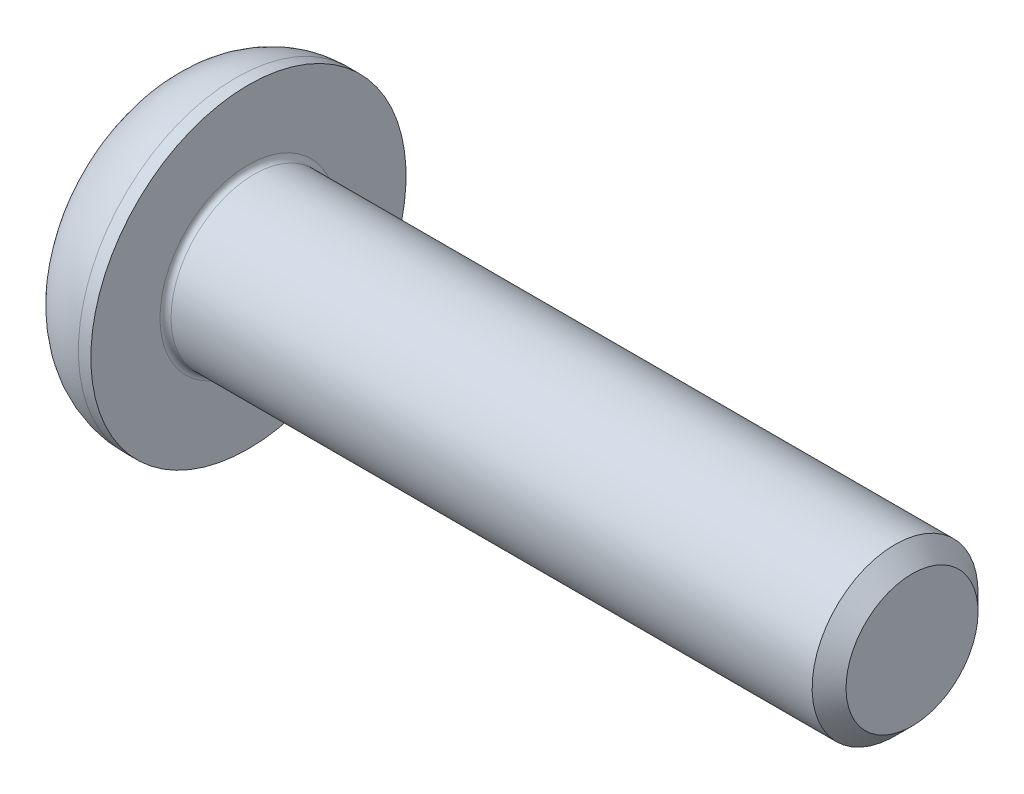
ISO-10303-21;
HEADER;
FILE_DESCRIPTION(('STEP AP214'),'2;1');
FILE_NAME('part.step','',(''),(''),'','','');
FILE_SCHEMA(('AUTOMOTIVE_DESIGN { 1 0 10303 214 1 1 1 1 }'));
ENDSEC;
DATA;
#1=APPLICATION_CONTEXT('core data for automotive mechanical design processes');
#2=APPLICATION_PROTOCOL_DEFINITION('international standard','automotive_design',2000,#1);
#3=PRODUCT_CONTEXT('',#1,'mechanical');
#4=PRODUCT('Part','Part','',(#3));
#5=PRODUCT_RELATED_PRODUCT_CATEGORY('part','',(#4));
#6=PRODUCT_DEFINITION_FORMATION('','',#4);
#7=PRODUCT_DEFINITION_CONTEXT('part definition',#1,'design');
#8=PRODUCT_DEFINITION('design','',#6,#7);
#9=PRODUCT_DEFINITION_SHAPE('','',#8);
#10=(LENGTH_UNIT() NAMED_UNIT(*) SI_UNIT(.MILLI.,.METRE.));
#11=(NAMED_UNIT(*) PLANE_ANGLE_UNIT() SI_UNIT($,.RADIAN.));
#12=(NAMED_UNIT(*) SI_UNIT($,.STERADIAN.) SOLID_ANGLE_UNIT());
#13=UNCERTAINTY_MEASURE_WITH_UNIT(LENGTH_MEASURE(1.E-05),#10,'distance_accuracy_value','');
#14=(GEOMETRIC_REPRESENTATION_CONTEXT(3) GLOBAL_UNCERTAINTY_ASSIGNED_CONTEXT((#13)) GLOBAL_UNIT_ASSIGNED_CONTEXT((#10,
#11,#12)) REPRESENTATION_CONTEXT('',''));
#15=CARTESIAN_POINT('',(0.,0.,0.));
#16=DIRECTION('',(0.,0.,1.));
#17=DIRECTION('',(1.,0.,0.));
#18=AXIS2_PLACEMENT_3D('',#15,#16,#17);
#19=CARTESIAN_POINT('',(0.100000000000002,0.,0.));
#20=DIRECTION('',(1.,0.,0.));
#21=DIRECTION('',(0.,1.,0.));
#22=AXIS2_PLACEMENT_3D('',#19,#20,#21);
#23=TOROIDAL_SURFACE('',#22,1.6,0.1);
#24=CARTESIAN_POINT('',(0.,0.,0.));
#25=DIRECTION('',(1.,0.,0.));
#26=DIRECTION('',(0.,1.,0.));
#27=AXIS2_PLACEMENT_3D('',#24,#25,#26);
#28=CIRCLE('',#27,1.6);
#29=CARTESIAN_POINT('',(0.,1.6,0.));
#30=VERTEX_POINT('',#29);
#31=EDGE_CURVE('E9',#30,#30,#28,.T.);
#32=ORIENTED_EDGE('',*,*,#31,.T.);
#33=EDGE_LOOP('',(#32));
#34=FACE_BOUND('',#33,.T.);
#35=CARTESIAN_POINT('',(0.100000000000002,0.,0.));
#36=DIRECTION('',(-1.,0.,0.));
#37=DIRECTION('',(0.,1.,0.));
#38=AXIS2_PLACEMENT_3D('',#35,#36,#37);
#39=CIRCLE('',#38,1.5);
#40=CARTESIAN_POINT('',(0.100000000000002,1.5,0.));
#41=VERTEX_POINT('',#40);
#42=EDGE_CURVE('E26',#41,#41,#39,.T.);
#43=ORIENTED_EDGE('',*,*,#42,.T.);
#44=EDGE_LOOP('',(#43));
#45=FACE_BOUND('',#44,.T.);
#46=ADVANCED_FACE('F15',(#34,#45),#23,.F.);
#47=CARTESIAN_POINT('',(6.5,0.,0.));
#48=DIRECTION('',(1.,0.,0.));
#49=DIRECTION('',(0.,1.,0.));
#50=AXIS2_PLACEMENT_3D('',#47,#48,#49);
#51=CYLINDRICAL_SURFACE('',#50,1.5);
#52=CARTESIAN_POINT('',(11.693275,0.,0.));
#53=DIRECTION('',(1.,0.,0.));
#54=DIRECTION('',(0.,1.,0.));
#55=AXIS2_PLACEMENT_3D('',#52,#53,#54);
#56=CIRCLE('',#55,1.5);
#57=CARTESIAN_POINT('',(11.693275,1.5,0.));
#58=VERTEX_POINT('',#57);
#59=EDGE_CURVE('E160',#58,#58,#56,.T.);
#60=ORIENTED_EDGE('',*,*,#59,.F.);
#61=EDGE_LOOP('',(#60));
#62=FACE_BOUND('',#61,.T.);
#63=ORIENTED_EDGE('',*,*,#42,.F.);
#64=EDGE_LOOP('',(#63));
#65=FACE_BOUND('',#64,.T.);
#66=ADVANCED_FACE('F170',(#62,#65),#51,.T.);
#67=CARTESIAN_POINT('',(0.,2.175,0.));
#68=DIRECTION('',(1.,0.,0.));
#69=DIRECTION('',(0.,1.,0.));
#70=AXIS2_PLACEMENT_3D('',#67,#68,#69);
#71=PLANE('',#70);
#72=CARTESIAN_POINT('',(0.,0.,0.));
#73=DIRECTION('',(1.,0.,0.));
#74=DIRECTION('',(0.,1.,0.));
#75=AXIS2_PLACEMENT_3D('',#72,#73,#74);
#76=CIRCLE('',#75,2.85);
#77=CARTESIAN_POINT('',(0.,2.85,0.));
#78=VERTEX_POINT('',#77);
#79=EDGE_CURVE('E161',#78,#78,#76,.T.);
#80=ORIENTED_EDGE('',*,*,#79,.T.);
#81=EDGE_LOOP('',(#80));
#82=FACE_BOUND('',#81,.T.);
#83=ORIENTED_EDGE('',*,*,#31,.F.);
#84=EDGE_LOOP('',(#83));
#85=FACE_BOUND('',#84,.T.);
#86=ADVANCED_FACE('F172',(#82,#85),#71,.T.);
#87=CARTESIAN_POINT('',(11.8466375,0.,0.));
#88=DIRECTION('',(-1.,0.,0.));
#89=DIRECTION('',(0.,1.,0.));
#90=AXIS2_PLACEMENT_3D('',#87,#88,#89);
#91=CONICAL_SURFACE('',#90,1.3466375,0.785398163397445);
#92=ORIENTED_EDGE('',*,*,#59,.T.);
#93=EDGE_LOOP('',(#92));
#94=FACE_BOUND('',#93,.T.);
#95=CARTESIAN_POINT('',(12.,0.,0.));
#96=DIRECTION('',(-1.,0.,0.));
#97=DIRECTION('',(0.,1.,0.));
#98=AXIS2_PLACEMENT_3D('',#95,#96,#97);
#99=CIRCLE('',#98,1.193275);
#100=CARTESIAN_POINT('',(12.,1.193275,0.));
#101=VERTEX_POINT('',#100);
#102=EDGE_CURVE('E157',#101,#101,#99,.T.);
#103=ORIENTED_EDGE('',*,*,#102,.T.);
#104=EDGE_LOOP('',(#103));
#105=FACE_BOUND('',#104,.T.);
#106=ADVANCED_FACE('F180',(#94,#105),#91,.T.);
#107=CARTESIAN_POINT('',(12.,0.75,0.));
#108=DIRECTION('',(1.,0.,0.));
#109=DIRECTION('',(0.,1.,0.));
#110=AXIS2_PLACEMENT_3D('',#107,#108,#109);
#111=PLANE('',#110);
#112=ORIENTED_EDGE('',*,*,#102,.F.);
#113=EDGE_LOOP('',(#112));
#114=FACE_BOUND('',#113,.T.);
#115=ADVANCED_FACE('F190',(#114),#111,.T.);
#116=CARTESIAN_POINT('',(-0.224999999999996,0.,0.));
#117=DIRECTION('',(1.,0.,0.));
#118=DIRECTION('',(0.,1.,0.));
#119=AXIS2_PLACEMENT_3D('',#116,#117,#118);
#120=TOROIDAL_SURFACE('',#119,1.425,1.425);
#121=CARTESIAN_POINT('',(-1.65,0.,0.));
#122=DIRECTION('',(1.,0.,0.));
#123=DIRECTION('',(0.,1.,0.));
#124=AXIS2_PLACEMENT_3D('',#121,#122,#123);
#125=CIRCLE('',#124,1.425);
#126=CARTESIAN_POINT('',(-1.65,1.425,0.));
#127=VERTEX_POINT('',#126);
#128=EDGE_CURVE('E154',#127,#127,#125,.T.);
#129=ORIENTED_EDGE('',*,*,#128,.T.);
#130=EDGE_LOOP('',(#129));
#131=FACE_BOUND('',#130,.T.);
#132=CARTESIAN_POINT('',(-0.224999999999996,0.,0.));
#133=DIRECTION('',(-1.,0.,0.));
#134=DIRECTION('',(0.,1.,0.));
#135=AXIS2_PLACEMENT_3D('',#132,#133,#134);
#136=CIRCLE('',#135,2.85);
#137=CARTESIAN_POINT('',(-0.224999999999996,2.85,0.));
#138=VERTEX_POINT('',#137);
#139=EDGE_CURVE('E151',#138,#138,#136,.T.);
#140=ORIENTED_EDGE('',*,*,#139,.T.);
#141=EDGE_LOOP('',(#140));
#142=FACE_BOUND('',#141,.T.);
#143=ADVANCED_FACE('F204',(#131,#142),#120,.T.);
#144=CARTESIAN_POINT('',(-1.65,2.00235026918963,0.));
#145=DIRECTION('',(-1.,0.,0.));
#146=DIRECTION('',(0.,-1.,0.));
#147=AXIS2_PLACEMENT_3D('',#144,#145,#146);
#148=PLANE('',#147);
#149=DIRECTION('',(0.,0.,1.));
#150=VECTOR('',#149,1.);
#151=CARTESIAN_POINT('',(-1.65,0.999999999999999,0.288675134594811));
#152=LINE('',#151,#150);
#153=CARTESIAN_POINT('',(-1.65,0.999999999999999,-0.577350269189626));
#154=VERTEX_POINT('',#153);
#155=CARTESIAN_POINT('',(-1.65,1.,0.577350269189624));
#156=VERTEX_POINT('',#155);
#157=EDGE_CURVE('E149',#154,#156,#152,.T.);
#158=ORIENTED_EDGE('',*,*,#157,.T.);
#159=DIRECTION('',(0.,-0.866025403784438,0.500000000000001));
#160=VECTOR('',#159,1.);
#161=CARTESIAN_POINT('',(-1.65,0.25,1.01036297108184));
#162=LINE('',#161,#160);
#163=CARTESIAN_POINT('',(-1.65,0.,1.15470053837925));
#164=VERTEX_POINT('',#163);
#165=EDGE_CURVE('E38',#156,#164,#162,.T.);
#166=ORIENTED_EDGE('',*,*,#165,.T.);
#167=DIRECTION('',(0.,-0.866025403784439,-0.5));
#168=VECTOR('',#167,1.);
#169=CARTESIAN_POINT('',(-1.65,-0.75,0.721687836487032));
#170=LINE('',#169,#168);
#171=CARTESIAN_POINT('',(-1.65,-1.,0.577350269189626));
#172=VERTEX_POINT('',#171);
#173=EDGE_CURVE('E94',#164,#172,#170,.T.);
#174=ORIENTED_EDGE('',*,*,#173,.T.);
#175=DIRECTION('',(0.,0.,-1.));
#176=VECTOR('',#175,1.);
#177=CARTESIAN_POINT('',(-1.65,-1.,-0.288675134594813));
#178=LINE('',#177,#176);
#179=CARTESIAN_POINT('',(-1.65,-1.,-0.577350269189625));
#180=VERTEX_POINT('',#179);
#181=EDGE_CURVE('E87',#172,#180,#178,.T.);
#182=ORIENTED_EDGE('',*,*,#181,.T.);
#183=DIRECTION('',(0.,0.866025403784438,-0.5));
#184=VECTOR('',#183,1.);
#185=CARTESIAN_POINT('',(-1.65,-0.25,-1.01036297108184));
#186=LINE('',#185,#184);
#187=CARTESIAN_POINT('',(-1.65,0.,-1.15470053837925));
#188=VERTEX_POINT('',#187);
#189=EDGE_CURVE('E143',#180,#188,#186,.T.);
#190=ORIENTED_EDGE('',*,*,#189,.T.);
#191=DIRECTION('',(0.,0.866025403784439,0.5));
#192=VECTOR('',#191,1.);
#193=CARTESIAN_POINT('',(-1.65,0.749999999999999,-0.721687836487032));
#194=LINE('',#193,#192);
#195=EDGE_CURVE('E134',#188,#154,#194,.T.);
#196=ORIENTED_EDGE('',*,*,#195,.T.);
#197=EDGE_LOOP('',(#158,#166,#174,#182,#190,#196));
#198=FACE_BOUND('',#197,.T.);
#199=ORIENTED_EDGE('',*,*,#128,.F.);
#200=EDGE_LOOP('',(#199));
#201=FACE_BOUND('',#200,.T.);
#202=ADVANCED_FACE('F195',(#198,#201),#148,.T.);
#203=CARTESIAN_POINT('',(-0.824999999999996,0.,0.));
#204=DIRECTION('',(1.,0.,0.));
#205=DIRECTION('',(0.,1.,0.));
#206=AXIS2_PLACEMENT_3D('',#203,#204,#205);
#207=CYLINDRICAL_SURFACE('',#206,2.85);
#208=ORIENTED_EDGE('',*,*,#79,.F.);
#209=EDGE_LOOP('',(#208));
#210=FACE_BOUND('',#209,.T.);
#211=ORIENTED_EDGE('',*,*,#139,.F.);
#212=EDGE_LOOP('',(#211));
#213=FACE_BOUND('',#212,.T.);
#214=ADVANCED_FACE('F192',(#210,#213),#207,.T.);
#215=CARTESIAN_POINT('',(-1.65,0.,-1.15470053837925));
#216=DIRECTION('',(0.,-0.5,-0.866025403784438));
#217=DIRECTION('',(0.,0.866025403784438,-0.5));
#218=AXIS2_PLACEMENT_3D('',#215,#216,#217);
#219=PLANE('',#218);
#220=CARTESIAN_POINT('',(-0.609999999999996,0.,-1.15470053837925));
#221=CARTESIAN_POINT('',(-0.443333333333329,-0.5,-0.866025403784438));
#222=CARTESIAN_POINT('',(-0.609999999999996,-1.,-0.577350269189625));
#223=(BOUNDED_CURVE() B_SPLINE_CURVE(2,(#220,#221,#222),.UNSPECIFIED.,.F.,
.F.) B_SPLINE_CURVE_WITH_KNOTS((3,3),(0.,0.116843613807792),
.UNSPECIFIED.) CURVE() GEOMETRIC_REPRESENTATION_ITEM() RATIONAL_B_SPLINE_CURVE((1.,
1.15470053837925,1.)) REPRESENTATION_ITEM(''));
#224=CARTESIAN_POINT('',(-0.609999999999996,0.,-1.15470053837925));
#225=VERTEX_POINT('',#224);
#226=CARTESIAN_POINT('',(-0.609999999999996,-1.,-0.577350269189625));
#227=VERTEX_POINT('',#226);
#228=EDGE_CURVE('E78',#225,#227,#223,.T.);
#229=ORIENTED_EDGE('',*,*,#228,.F.);
#230=DIRECTION('',(-1.,0.,0.));
#231=VECTOR('',#230,1.);
#232=CARTESIAN_POINT('',(-1.13,0.,-1.15470053837925));
#233=LINE('',#232,#231);
#234=EDGE_CURVE('E124',#225,#188,#233,.T.);
#235=ORIENTED_EDGE('',*,*,#234,.T.);
#236=ORIENTED_EDGE('',*,*,#189,.F.);
#237=DIRECTION('',(-1.,0.,0.));
#238=VECTOR('',#237,1.);
#239=CARTESIAN_POINT('',(-1.13,-1.,-0.577350269189625));
#240=LINE('',#239,#238);
#241=EDGE_CURVE('E90',#227,#180,#240,.T.);
#242=ORIENTED_EDGE('',*,*,#241,.F.);
#243=EDGE_LOOP('',(#229,#235,#236,#242));
#244=FACE_BOUND('',#243,.T.);
#245=ADVANCED_FACE('F194',(#244),#219,.F.);
#246=CARTESIAN_POINT('',(-1.65,0.999999999999999,-0.577350269189626));
#247=DIRECTION('',(0.,0.5,-0.866025403784439));
#248=DIRECTION('',(0.,0.866025403784439,0.5));
#249=AXIS2_PLACEMENT_3D('',#246,#247,#248);
#250=PLANE('',#249);
#251=CARTESIAN_POINT('',(-0.609999999999996,1.,-0.577350269189626));
#252=CARTESIAN_POINT('',(-0.443333333333329,0.499999999999999,-0.866025403784439));
#253=CARTESIAN_POINT('',(-0.609999999999996,0.,-1.15470053837925));
#254=(BOUNDED_CURVE() B_SPLINE_CURVE(2,(#251,#252,#253),.UNSPECIFIED.,.F.,
.F.) B_SPLINE_CURVE_WITH_KNOTS((3,3),(0.,0.116843613807792),
.UNSPECIFIED.) CURVE() GEOMETRIC_REPRESENTATION_ITEM() RATIONAL_B_SPLINE_CURVE((1.,
1.15470053837925,1.)) REPRESENTATION_ITEM(''));
#255=CARTESIAN_POINT('',(-0.609999999999996,0.999999999999999,-0.577350269189628));
#256=VERTEX_POINT('',#255);
#257=EDGE_CURVE('E118',#256,#225,#254,.T.);
#258=ORIENTED_EDGE('',*,*,#257,.F.);
#259=DIRECTION('',(-1.,0.,0.));
#260=VECTOR('',#259,1.);
#261=CARTESIAN_POINT('',(-1.13,0.999999999999999,-0.577350269189628));
#262=LINE('',#261,#260);
#263=EDGE_CURVE('E113',#256,#154,#262,.T.);
#264=ORIENTED_EDGE('',*,*,#263,.T.);
#265=ORIENTED_EDGE('',*,*,#195,.F.);
#266=ORIENTED_EDGE('',*,*,#234,.F.);
#267=EDGE_LOOP('',(#258,#264,#265,#266));
#268=FACE_BOUND('',#267,.T.);
#269=ADVANCED_FACE('F201',(#268),#250,.F.);
#270=CARTESIAN_POINT('',(-1.65,1.,0.577350269189624));
#271=DIRECTION('',(0.,1.,0.));
#272=DIRECTION('',(0.,0.,1.));
#273=AXIS2_PLACEMENT_3D('',#270,#271,#272);
#274=PLANE('',#273);
#275=CARTESIAN_POINT('',(-0.609999999999996,1.,0.577350269189626));
#276=CARTESIAN_POINT('',(-0.443333333333329,0.999999999999999,0.));
#277=CARTESIAN_POINT('',(-0.609999999999996,0.999999999999999,-0.577350269189628));
#278=(BOUNDED_CURVE() B_SPLINE_CURVE(2,(#275,#276,#277),.UNSPECIFIED.,.F.,
.F.) B_SPLINE_CURVE_WITH_KNOTS((3,3),(0.,0.116843613807792),
.UNSPECIFIED.) CURVE() GEOMETRIC_REPRESENTATION_ITEM() RATIONAL_B_SPLINE_CURVE((1.,
1.15470053837925,1.)) REPRESENTATION_ITEM(''));
#279=CARTESIAN_POINT('',(-0.609999999999996,1.,0.577350269189623));
#280=VERTEX_POINT('',#279);
#281=EDGE_CURVE('E97',#280,#256,#278,.T.);
#282=ORIENTED_EDGE('',*,*,#281,.F.);
#283=DIRECTION('',(-1.,0.,0.));
#284=VECTOR('',#283,1.);
#285=CARTESIAN_POINT('',(-1.13,1.,0.577350269189623));
#286=LINE('',#285,#284);
#287=EDGE_CURVE('E107',#280,#156,#286,.T.);
#288=ORIENTED_EDGE('',*,*,#287,.T.);
#289=ORIENTED_EDGE('',*,*,#157,.F.);
#290=ORIENTED_EDGE('',*,*,#263,.F.);
#291=EDGE_LOOP('',(#282,#288,#289,#290));
#292=FACE_BOUND('',#291,.T.);
#293=ADVANCED_FACE('F222',(#292),#274,.F.);
#294=CARTESIAN_POINT('',(-1.65,0.,1.15470053837925));
#295=DIRECTION('',(0.,0.500000000000001,0.866025403784438));
#296=DIRECTION('',(0.,-0.866025403784438,0.500000000000001));
#297=AXIS2_PLACEMENT_3D('',#294,#295,#296);
#298=PLANE('',#297);
#299=CARTESIAN_POINT('',(-0.609999999999996,0.,1.15470053837925));
#300=CARTESIAN_POINT('',(-0.443333333333329,0.5,0.866025403784437));
#301=CARTESIAN_POINT('',(-0.609999999999996,1.,0.577350269189623));
#302=(BOUNDED_CURVE() B_SPLINE_CURVE(2,(#299,#300,#301),.UNSPECIFIED.,.F.,
.F.) B_SPLINE_CURVE_WITH_KNOTS((3,3),(0.,0.116843613807792),
.UNSPECIFIED.) CURVE() GEOMETRIC_REPRESENTATION_ITEM() RATIONAL_B_SPLINE_CURVE((1.,
1.15470053837926,1.)) REPRESENTATION_ITEM(''));
#303=CARTESIAN_POINT('',(-0.609999999999996,0.,1.15470053837925));
#304=VERTEX_POINT('',#303);
#305=EDGE_CURVE('E95',#304,#280,#302,.T.);
#306=ORIENTED_EDGE('',*,*,#305,.F.);
#307=DIRECTION('',(1.,0.,0.));
#308=VECTOR('',#307,1.);
#309=CARTESIAN_POINT('',(-1.13,0.,1.15470053837925));
#310=LINE('',#309,#308);
#311=EDGE_CURVE('E91',#164,#304,#310,.T.);
#312=ORIENTED_EDGE('',*,*,#311,.F.);
#313=ORIENTED_EDGE('',*,*,#165,.F.);
#314=ORIENTED_EDGE('',*,*,#287,.F.);
#315=EDGE_LOOP('',(#306,#312,#313,#314));
#316=FACE_BOUND('',#315,.T.);
#317=ADVANCED_FACE('F226',(#316),#298,.F.);
#318=CARTESIAN_POINT('',(-1.65,-1.,-0.577350269189625));
#319=DIRECTION('',(0.,-1.,0.));
#320=DIRECTION('',(1.,0.,0.));
#321=AXIS2_PLACEMENT_3D('',#318,#319,#320);
#322=PLANE('',#321);
#323=CARTESIAN_POINT('',(-0.609999999999996,-1.,-0.577350269189626));
#324=CARTESIAN_POINT('',(-0.443333333333329,-1.,0.));
#325=CARTESIAN_POINT('',(-0.609999999999996,-1.,0.577350269189626));
#326=(BOUNDED_CURVE() B_SPLINE_CURVE(2,(#323,#324,#325),.UNSPECIFIED.,.F.,
.F.) B_SPLINE_CURVE_WITH_KNOTS((3,3),(0.,0.116843613807792),
.UNSPECIFIED.) CURVE() GEOMETRIC_REPRESENTATION_ITEM() RATIONAL_B_SPLINE_CURVE((1.,
1.15470053837925,1.)) REPRESENTATION_ITEM(''));
#327=CARTESIAN_POINT('',(-0.609999999999996,-1.,0.577350269189626));
#328=VERTEX_POINT('',#327);
#329=EDGE_CURVE('E73',#227,#328,#326,.T.);
#330=ORIENTED_EDGE('',*,*,#329,.F.);
#331=ORIENTED_EDGE('',*,*,#241,.T.);
#332=ORIENTED_EDGE('',*,*,#181,.F.);
#333=DIRECTION('',(-1.,0.,0.));
#334=VECTOR('',#333,1.);
#335=CARTESIAN_POINT('',(-1.13,-1.,0.577350269189626));
#336=LINE('',#335,#334);
#337=EDGE_CURVE('E84',#328,#172,#336,.T.);
#338=ORIENTED_EDGE('',*,*,#337,.F.);
#339=EDGE_LOOP('',(#330,#331,#332,#338));
#340=FACE_BOUND('',#339,.T.);
#341=ADVANCED_FACE('F85',(#340),#322,.F.);
#342=CARTESIAN_POINT('',(-1.65,-1.,0.577350269189626));
#343=DIRECTION('',(0.,-0.5,0.866025403784439));
#344=DIRECTION('',(0.,-0.866025403784439,-0.5));
#345=AXIS2_PLACEMENT_3D('',#342,#343,#344);
#346=PLANE('',#345);
#347=CARTESIAN_POINT('',(-0.609999999999996,-1.,0.577350269189626));
#348=CARTESIAN_POINT('',(-0.443333333333329,-0.500000000000001,0.866025403784438));
#349=CARTESIAN_POINT('',(-0.609999999999996,0.,1.15470053837925));
#350=(BOUNDED_CURVE() B_SPLINE_CURVE(2,(#347,#348,#349),.UNSPECIFIED.,.F.,
.F.) B_SPLINE_CURVE_WITH_KNOTS((3,3),(0.,0.116843613807792),
.UNSPECIFIED.) CURVE() GEOMETRIC_REPRESENTATION_ITEM() RATIONAL_B_SPLINE_CURVE((1.,
1.15470053837925,1.)) REPRESENTATION_ITEM(''));
#351=EDGE_CURVE('E19',#328,#304,#350,.T.);
#352=ORIENTED_EDGE('',*,*,#351,.F.);
#353=ORIENTED_EDGE('',*,*,#337,.T.);
#354=ORIENTED_EDGE('',*,*,#173,.F.);
#355=ORIENTED_EDGE('',*,*,#311,.T.);
#356=EDGE_LOOP('',(#352,#353,#354,#355));
#357=FACE_BOUND('',#356,.T.);
#358=ADVANCED_FACE('F93',(#357),#346,.F.);
#359=CARTESIAN_POINT('',(-0.276666666666663,0.,0.));
#360=DIRECTION('',(-1.,0.,0.));
#361=DIRECTION('',(0.,1.,0.));
#362=AXIS2_PLACEMENT_3D('',#359,#360,#361);
#363=CONICAL_SURFACE('',#362,0.577350269189626,1.0471975511966);
#364=CARTESIAN_POINT('',(0.0566666666666704,0.,0.));
#365=VERTEX_POINT('',#364);
#366=VERTEX_LOOP('',#365);
#367=FACE_BOUND('',#366,.T.);
#368=ORIENTED_EDGE('',*,*,#305,.T.);
#369=ORIENTED_EDGE('',*,*,#281,.T.);
#370=ORIENTED_EDGE('',*,*,#257,.T.);
#371=ORIENTED_EDGE('',*,*,#228,.T.);
#372=ORIENTED_EDGE('',*,*,#329,.T.);
#373=ORIENTED_EDGE('',*,*,#351,.T.);
#374=EDGE_LOOP('',(#368,#369,#370,#371,#372,#373));
#375=FACE_BOUND('',#374,.T.);
#376=ADVANCED_FACE('F17',(#367,#375),#363,.F.);
#377=CLOSED_SHELL('',(#46,#66,#86,#106,#115,#143,#202,#214,#245,#269,#293,#317,#341,#358,#376));
#378=MANIFOLD_SOLID_BREP('B1',#377);
#379=ADVANCED_BREP_SHAPE_REPRESENTATION('',(#18,#378),#14);
#380=SHAPE_DEFINITION_REPRESENTATION(#9,#379);
ENDSEC;
END-ISO-10303-21;
